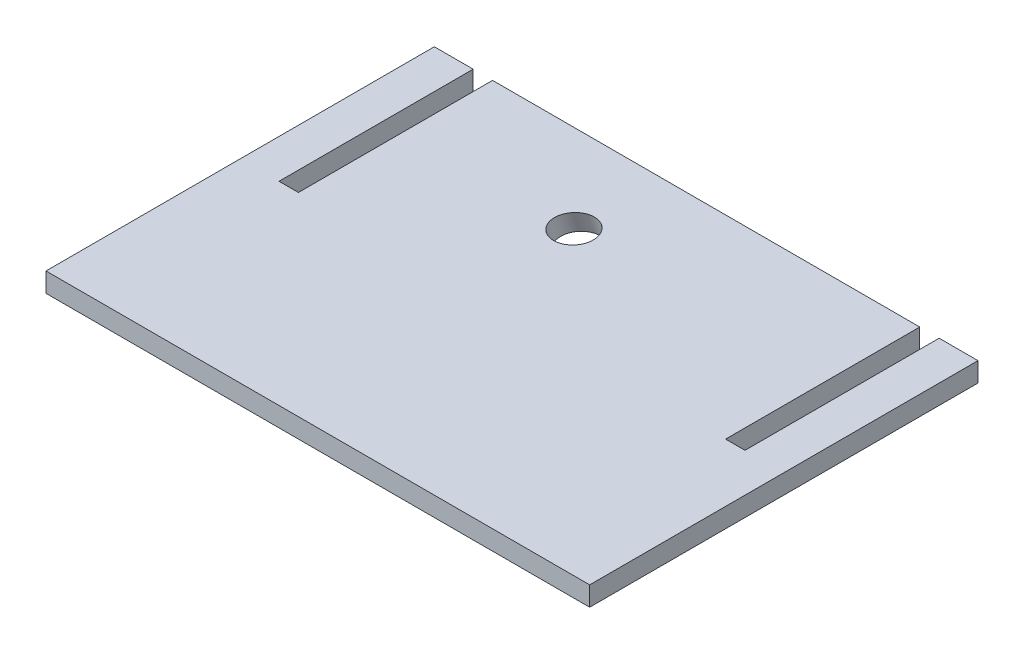
ISO-10303-21;
HEADER;
FILE_DESCRIPTION(('STEP AP214'),'2;1');
FILE_NAME('part.step','',(''),(''),'','','');
FILE_SCHEMA(('AUTOMOTIVE_DESIGN { 1 0 10303 214 1 1 1 1 }'));
ENDSEC;
DATA;
#1=APPLICATION_CONTEXT('core data for automotive mechanical design processes');
#2=APPLICATION_PROTOCOL_DEFINITION('international standard','automotive_design',2000,#1);
#3=PRODUCT_CONTEXT('',#1,'mechanical');
#4=PRODUCT('Part','Part','',(#3));
#5=PRODUCT_RELATED_PRODUCT_CATEGORY('part','',(#4));
#6=PRODUCT_DEFINITION_FORMATION('','',#4);
#7=PRODUCT_DEFINITION_CONTEXT('part definition',#1,'design');
#8=PRODUCT_DEFINITION('design','',#6,#7);
#9=PRODUCT_DEFINITION_SHAPE('','',#8);
#10=(LENGTH_UNIT() NAMED_UNIT(*) SI_UNIT(.MILLI.,.METRE.));
#11=(NAMED_UNIT(*) PLANE_ANGLE_UNIT() SI_UNIT($,.RADIAN.));
#12=(NAMED_UNIT(*) SI_UNIT($,.STERADIAN.) SOLID_ANGLE_UNIT());
#13=UNCERTAINTY_MEASURE_WITH_UNIT(LENGTH_MEASURE(1.E-05),#10,'distance_accuracy_value','');
#14=(GEOMETRIC_REPRESENTATION_CONTEXT(3) GLOBAL_UNCERTAINTY_ASSIGNED_CONTEXT((#13)) GLOBAL_UNIT_ASSIGNED_CONTEXT((#10,
#11,#12)) REPRESENTATION_CONTEXT('',''));
#15=CARTESIAN_POINT('',(0.,0.,0.));
#16=DIRECTION('',(0.,0.,1.));
#17=DIRECTION('',(1.,0.,0.));
#18=AXIS2_PLACEMENT_3D('',#15,#16,#17);
#19=CARTESIAN_POINT('',(-177.8,6.35,-127.));
#20=DIRECTION('',(0.,0.,1.));
#21=DIRECTION('',(1.,0.,0.));
#22=AXIS2_PLACEMENT_3D('',#19,#20,#21);
#23=PLANE('',#22);
#24=DIRECTION('',(-1.,0.,0.));
#25=VECTOR('',#24,1.);
#26=CARTESIAN_POINT('',(-177.8,6.35,-127.));
#27=LINE('',#26,#25);
#28=CARTESIAN_POINT('',(-152.4,6.35,-127.));
#29=VERTEX_POINT('',#28);
#30=CARTESIAN_POINT('',(-177.8,6.35,-127.));
#31=VERTEX_POINT('',#30);
#32=EDGE_CURVE('E193',#29,#31,#27,.T.);
#33=ORIENTED_EDGE('',*,*,#32,.F.);
#34=DIRECTION('',(0.,1.,0.));
#35=VECTOR('',#34,1.);
#36=CARTESIAN_POINT('',(-152.4,-6.35,-127.));
#37=LINE('',#36,#35);
#38=CARTESIAN_POINT('',(-152.4,-6.35,-127.));
#39=VERTEX_POINT('',#38);
#40=EDGE_CURVE('E179',#39,#29,#37,.T.);
#41=ORIENTED_EDGE('',*,*,#40,.F.);
#42=DIRECTION('',(-1.,0.,0.));
#43=VECTOR('',#42,1.);
#44=CARTESIAN_POINT('',(-177.8,-6.35,-127.));
#45=LINE('',#44,#43);
#46=CARTESIAN_POINT('',(-177.8,-6.35,-127.));
#47=VERTEX_POINT('',#46);
#48=EDGE_CURVE('E227',#39,#47,#45,.T.);
#49=ORIENTED_EDGE('',*,*,#48,.T.);
#50=DIRECTION('',(0.,-1.,0.));
#51=VECTOR('',#50,1.);
#52=CARTESIAN_POINT('',(-177.8,6.35,-127.));
#53=LINE('',#52,#51);
#54=EDGE_CURVE('E216',#31,#47,#53,.T.);
#55=ORIENTED_EDGE('',*,*,#54,.F.);
#56=EDGE_LOOP('',(#33,#41,#49,#55));
#57=FACE_BOUND('',#56,.T.);
#58=ADVANCED_FACE('F37',(#57),#23,.F.);
#59=CARTESIAN_POINT('',(139.7,-6.35,-127.));
#60=VERTEX_POINT('',#59);
#61=CARTESIAN_POINT('',(-139.7,-6.35,-127.));
#62=VERTEX_POINT('',#61);
#63=EDGE_CURVE('E178',#60,#62,#45,.T.);
#64=ORIENTED_EDGE('',*,*,#63,.T.);
#65=DIRECTION('',(0.,1.,0.));
#66=VECTOR('',#65,1.);
#67=CARTESIAN_POINT('',(-139.7,-6.35,-127.));
#68=LINE('',#67,#66);
#69=CARTESIAN_POINT('',(-139.7,6.35,-127.));
#70=VERTEX_POINT('',#69);
#71=EDGE_CURVE('E72',#62,#70,#68,.T.);
#72=ORIENTED_EDGE('',*,*,#71,.T.);
#73=CARTESIAN_POINT('',(139.7,6.35,-127.));
#74=VERTEX_POINT('',#73);
#75=EDGE_CURVE('E189',#74,#70,#27,.T.);
#76=ORIENTED_EDGE('',*,*,#75,.F.);
#77=DIRECTION('',(0.,1.,0.));
#78=VECTOR('',#77,1.);
#79=CARTESIAN_POINT('',(139.7,-6.35,-127.));
#80=LINE('',#79,#78);
#81=EDGE_CURVE('E162',#60,#74,#80,.T.);
#82=ORIENTED_EDGE('',*,*,#81,.F.);
#83=EDGE_LOOP('',(#64,#72,#76,#82));
#84=FACE_BOUND('',#83,.T.);
#85=ADVANCED_FACE('F253',(#84),#23,.F.);
#86=CARTESIAN_POINT('',(177.8,6.35,-127.));
#87=DIRECTION('',(-1.,0.,0.));
#88=DIRECTION('',(0.,0.,1.));
#89=AXIS2_PLACEMENT_3D('',#86,#87,#88);
#90=PLANE('',#89);
#91=DIRECTION('',(0.,0.,-1.));
#92=VECTOR('',#91,1.);
#93=CARTESIAN_POINT('',(177.8,-6.35,-127.));
#94=LINE('',#93,#92);
#95=CARTESIAN_POINT('',(177.8,-6.35,127.));
#96=VERTEX_POINT('',#95);
#97=CARTESIAN_POINT('',(177.8,-6.35,-127.));
#98=VERTEX_POINT('',#97);
#99=EDGE_CURVE('E177',#96,#98,#94,.T.);
#100=ORIENTED_EDGE('',*,*,#99,.T.);
#101=DIRECTION('',(0.,-1.,0.));
#102=VECTOR('',#101,1.);
#103=CARTESIAN_POINT('',(177.8,6.35,-127.));
#104=LINE('',#103,#102);
#105=CARTESIAN_POINT('',(177.8,6.35,-127.));
#106=VERTEX_POINT('',#105);
#107=EDGE_CURVE('E167',#106,#98,#104,.T.);
#108=ORIENTED_EDGE('',*,*,#107,.F.);
#109=DIRECTION('',(0.,0.,-1.));
#110=VECTOR('',#109,1.);
#111=CARTESIAN_POINT('',(177.8,6.35,-127.));
#112=LINE('',#111,#110);
#113=CARTESIAN_POINT('',(177.8,6.35,127.));
#114=VERTEX_POINT('',#113);
#115=EDGE_CURVE('E198',#114,#106,#112,.T.);
#116=ORIENTED_EDGE('',*,*,#115,.F.);
#117=DIRECTION('',(0.,-1.,0.));
#118=VECTOR('',#117,1.);
#119=CARTESIAN_POINT('',(177.8,6.35,127.));
#120=LINE('',#119,#118);
#121=EDGE_CURVE('E221',#114,#96,#120,.T.);
#122=ORIENTED_EDGE('',*,*,#121,.T.);
#123=EDGE_LOOP('',(#100,#108,#116,#122));
#124=FACE_BOUND('',#123,.T.);
#125=ADVANCED_FACE('F236',(#124),#90,.F.);
#126=CARTESIAN_POINT('',(152.4,-6.35,-127.));
#127=VERTEX_POINT('',#126);
#128=EDGE_CURVE('E168',#98,#127,#45,.T.);
#129=ORIENTED_EDGE('',*,*,#128,.T.);
#130=DIRECTION('',(0.,1.,0.));
#131=VECTOR('',#130,1.);
#132=CARTESIAN_POINT('',(152.4,-6.35,-127.));
#133=LINE('',#132,#131);
#134=CARTESIAN_POINT('',(152.4,6.35,-127.));
#135=VERTEX_POINT('',#134);
#136=EDGE_CURVE('E135',#127,#135,#133,.T.);
#137=ORIENTED_EDGE('',*,*,#136,.T.);
#138=EDGE_CURVE('E191',#106,#135,#27,.T.);
#139=ORIENTED_EDGE('',*,*,#138,.F.);
#140=ORIENTED_EDGE('',*,*,#107,.T.);
#141=EDGE_LOOP('',(#129,#137,#139,#140));
#142=FACE_BOUND('',#141,.T.);
#143=ADVANCED_FACE('F239',(#142),#23,.F.);
#144=CARTESIAN_POINT('',(-177.8,6.35,-127.));
#145=DIRECTION('',(1.,0.,0.));
#146=DIRECTION('',(0.,0.,-1.));
#147=AXIS2_PLACEMENT_3D('',#144,#145,#146);
#148=PLANE('',#147);
#149=DIRECTION('',(0.,0.,1.));
#150=VECTOR('',#149,1.);
#151=CARTESIAN_POINT('',(-177.8,-6.35,-127.));
#152=LINE('',#151,#150);
#153=CARTESIAN_POINT('',(-177.8,-6.35,127.));
#154=VERTEX_POINT('',#153);
#155=EDGE_CURVE('E224',#47,#154,#152,.T.);
#156=ORIENTED_EDGE('',*,*,#155,.T.);
#157=DIRECTION('',(0.,-1.,0.));
#158=VECTOR('',#157,1.);
#159=CARTESIAN_POINT('',(-177.8,6.35,127.));
#160=LINE('',#159,#158);
#161=CARTESIAN_POINT('',(-177.8,6.35,127.));
#162=VERTEX_POINT('',#161);
#163=EDGE_CURVE('E206',#162,#154,#160,.T.);
#164=ORIENTED_EDGE('',*,*,#163,.F.);
#165=DIRECTION('',(0.,0.,1.));
#166=VECTOR('',#165,1.);
#167=CARTESIAN_POINT('',(-177.8,6.35,-127.));
#168=LINE('',#167,#166);
#169=EDGE_CURVE('E200',#31,#162,#168,.T.);
#170=ORIENTED_EDGE('',*,*,#169,.F.);
#171=ORIENTED_EDGE('',*,*,#54,.T.);
#172=EDGE_LOOP('',(#156,#164,#170,#171));
#173=FACE_BOUND('',#172,.T.);
#174=ADVANCED_FACE('F243',(#173),#148,.F.);
#175=CARTESIAN_POINT('',(-177.8,6.35,127.));
#176=DIRECTION('',(0.,0.,-1.));
#177=DIRECTION('',(-1.,0.,0.));
#178=AXIS2_PLACEMENT_3D('',#175,#176,#177);
#179=PLANE('',#178);
#180=DIRECTION('',(1.,0.,0.));
#181=VECTOR('',#180,1.);
#182=CARTESIAN_POINT('',(-177.8,-6.35,127.));
#183=LINE('',#182,#181);
#184=EDGE_CURVE('E210',#154,#96,#183,.T.);
#185=ORIENTED_EDGE('',*,*,#184,.T.);
#186=ORIENTED_EDGE('',*,*,#121,.F.);
#187=DIRECTION('',(1.,0.,0.));
#188=VECTOR('',#187,1.);
#189=CARTESIAN_POINT('',(-177.8,6.35,127.));
#190=LINE('',#189,#188);
#191=EDGE_CURVE('E204',#162,#114,#190,.T.);
#192=ORIENTED_EDGE('',*,*,#191,.F.);
#193=ORIENTED_EDGE('',*,*,#163,.T.);
#194=EDGE_LOOP('',(#185,#186,#192,#193));
#195=FACE_BOUND('',#194,.T.);
#196=ADVANCED_FACE('F241',(#195),#179,.F.);
#197=CARTESIAN_POINT('',(0.,6.35,0.));
#198=DIRECTION('',(0.,1.,0.));
#199=DIRECTION('',(0.,0.,1.));
#200=AXIS2_PLACEMENT_3D('',#197,#198,#199);
#201=PLANE('',#200);
#202=CARTESIAN_POINT('',(-29.0632633217922,6.35,-69.5494140717823));
#203=DIRECTION('',(0.,1.,0.));
#204=DIRECTION('',(0.,0.,1.));
#205=AXIS2_PLACEMENT_3D('',#202,#203,#204);
#206=ELLIPSE('',#205,13.3301795384042,12.7);
#207=CARTESIAN_POINT('',(-29.0632633217924,6.35,-56.2192345333782));
#208=VERTEX_POINT('',#207);
#209=EDGE_CURVE('E41',#208,#208,#206,.F.);
#210=ORIENTED_EDGE('',*,*,#209,.T.);
#211=EDGE_LOOP('',(#210));
#212=FACE_BOUND('',#211,.T.);
#213=DIRECTION('',(0.,0.,1.));
#214=VECTOR('',#213,1.);
#215=CARTESIAN_POINT('',(-152.4,6.35,-127.));
#216=LINE('',#215,#214);
#217=CARTESIAN_POINT('',(-152.4,6.35,0.));
#218=VERTEX_POINT('',#217);
#219=EDGE_CURVE('E171',#29,#218,#216,.T.);
#220=ORIENTED_EDGE('',*,*,#219,.F.);
#221=ORIENTED_EDGE('',*,*,#32,.T.);
#222=ORIENTED_EDGE('',*,*,#169,.T.);
#223=ORIENTED_EDGE('',*,*,#191,.T.);
#224=ORIENTED_EDGE('',*,*,#115,.T.);
#225=ORIENTED_EDGE('',*,*,#138,.T.);
#226=DIRECTION('',(0.,0.,-1.));
#227=VECTOR('',#226,1.);
#228=CARTESIAN_POINT('',(152.4,6.35,-127.));
#229=LINE('',#228,#227);
#230=CARTESIAN_POINT('',(152.4,6.35,0.));
#231=VERTEX_POINT('',#230);
#232=EDGE_CURVE('E149',#231,#135,#229,.T.);
#233=ORIENTED_EDGE('',*,*,#232,.F.);
#234=DIRECTION('',(1.,0.,0.));
#235=VECTOR('',#234,1.);
#236=CARTESIAN_POINT('',(139.7,6.35,0.));
#237=LINE('',#236,#235);
#238=CARTESIAN_POINT('',(139.7,6.35,0.));
#239=VERTEX_POINT('',#238);
#240=EDGE_CURVE('E147',#239,#231,#237,.T.);
#241=ORIENTED_EDGE('',*,*,#240,.F.);
#242=DIRECTION('',(0.,0.,1.));
#243=VECTOR('',#242,1.);
#244=CARTESIAN_POINT('',(139.7,6.35,-127.));
#245=LINE('',#244,#243);
#246=EDGE_CURVE('E139',#74,#239,#245,.T.);
#247=ORIENTED_EDGE('',*,*,#246,.F.);
#248=ORIENTED_EDGE('',*,*,#75,.T.);
#249=DIRECTION('',(0.,0.,-1.));
#250=VECTOR('',#249,1.);
#251=CARTESIAN_POINT('',(-139.7,6.35,-127.));
#252=LINE('',#251,#250);
#253=CARTESIAN_POINT('',(-139.7,6.35,0.));
#254=VERTEX_POINT('',#253);
#255=EDGE_CURVE('E76',#254,#70,#252,.T.);
#256=ORIENTED_EDGE('',*,*,#255,.F.);
#257=DIRECTION('',(1.,0.,0.));
#258=VECTOR('',#257,1.);
#259=CARTESIAN_POINT('',(-152.4,6.35,0.));
#260=LINE('',#259,#258);
#261=EDGE_CURVE('E173',#218,#254,#260,.T.);
#262=ORIENTED_EDGE('',*,*,#261,.F.);
#263=EDGE_LOOP('',(#220,#221,#222,#223,#224,#225,#233,#241,#247,#248,#256,#262));
#264=FACE_BOUND('',#263,.T.);
#265=ADVANCED_FACE('F39',(#212,#264),#201,.T.);
#266=CARTESIAN_POINT('',(0.,-6.35,0.));
#267=DIRECTION('',(0.,1.,0.));
#268=DIRECTION('',(0.,0.,1.));
#269=AXIS2_PLACEMENT_3D('',#266,#267,#268);
#270=PLANE('',#269);
#271=CARTESIAN_POINT('',(-29.0632633217922,-6.35,-73.5995605538357));
#272=DIRECTION('',(0.,1.,0.));
#273=DIRECTION('',(0.,0.,1.));
#274=AXIS2_PLACEMENT_3D('',#271,#272,#273);
#275=ELLIPSE('',#274,13.3301795384042,12.7);
#276=CARTESIAN_POINT('',(-29.0632633217923,-6.35,-60.2693810154316));
#277=VERTEX_POINT('',#276);
#278=EDGE_CURVE('E11',#277,#277,#275,.F.);
#279=ORIENTED_EDGE('',*,*,#278,.F.);
#280=EDGE_LOOP('',(#279));
#281=FACE_BOUND('',#280,.T.);
#282=ORIENTED_EDGE('',*,*,#48,.F.);
#283=DIRECTION('',(0.,0.,1.));
#284=VECTOR('',#283,1.);
#285=CARTESIAN_POINT('',(-152.4,-6.35,-127.));
#286=LINE('',#285,#284);
#287=CARTESIAN_POINT('',(-152.4,-6.35,0.));
#288=VERTEX_POINT('',#287);
#289=EDGE_CURVE('E187',#39,#288,#286,.T.);
#290=ORIENTED_EDGE('',*,*,#289,.T.);
#291=DIRECTION('',(1.,0.,0.));
#292=VECTOR('',#291,1.);
#293=CARTESIAN_POINT('',(-152.4,-6.35,0.));
#294=LINE('',#293,#292);
#295=CARTESIAN_POINT('',(-139.7,-6.35,0.));
#296=VERTEX_POINT('',#295);
#297=EDGE_CURVE('E185',#288,#296,#294,.T.);
#298=ORIENTED_EDGE('',*,*,#297,.T.);
#299=DIRECTION('',(0.,0.,-1.));
#300=VECTOR('',#299,1.);
#301=CARTESIAN_POINT('',(-139.7,-6.35,-127.));
#302=LINE('',#301,#300);
#303=EDGE_CURVE('E156',#296,#62,#302,.T.);
#304=ORIENTED_EDGE('',*,*,#303,.T.);
#305=ORIENTED_EDGE('',*,*,#63,.F.);
#306=DIRECTION('',(0.,0.,1.));
#307=VECTOR('',#306,1.);
#308=CARTESIAN_POINT('',(139.7,-6.35,-127.));
#309=LINE('',#308,#307);
#310=CARTESIAN_POINT('',(139.7,-6.35,0.));
#311=VERTEX_POINT('',#310);
#312=EDGE_CURVE('E154',#60,#311,#309,.T.);
#313=ORIENTED_EDGE('',*,*,#312,.T.);
#314=DIRECTION('',(1.,0.,0.));
#315=VECTOR('',#314,1.);
#316=CARTESIAN_POINT('',(139.7,-6.35,0.));
#317=LINE('',#316,#315);
#318=CARTESIAN_POINT('',(152.4,-6.35,0.));
#319=VERTEX_POINT('',#318);
#320=EDGE_CURVE('E140',#311,#319,#317,.T.);
#321=ORIENTED_EDGE('',*,*,#320,.T.);
#322=DIRECTION('',(0.,0.,-1.));
#323=VECTOR('',#322,1.);
#324=CARTESIAN_POINT('',(152.4,-6.35,-127.));
#325=LINE('',#324,#323);
#326=EDGE_CURVE('E129',#319,#127,#325,.T.);
#327=ORIENTED_EDGE('',*,*,#326,.T.);
#328=ORIENTED_EDGE('',*,*,#128,.F.);
#329=ORIENTED_EDGE('',*,*,#99,.F.);
#330=ORIENTED_EDGE('',*,*,#184,.F.);
#331=ORIENTED_EDGE('',*,*,#155,.F.);
#332=EDGE_LOOP('',(#282,#290,#298,#304,#305,#313,#321,#327,#328,#329,#330,#331));
#333=FACE_BOUND('',#332,.T.);
#334=ADVANCED_FACE('F152',(#281,#333),#270,.F.);
#335=CARTESIAN_POINT('',(139.7,-6.35,-127.));
#336=DIRECTION('',(-1.,0.,0.));
#337=DIRECTION('',(0.,0.,1.));
#338=AXIS2_PLACEMENT_3D('',#335,#336,#337);
#339=PLANE('',#338);
#340=ORIENTED_EDGE('',*,*,#246,.T.);
#341=DIRECTION('',(0.,1.,0.));
#342=VECTOR('',#341,1.);
#343=CARTESIAN_POINT('',(139.7,-6.35,0.));
#344=LINE('',#343,#342);
#345=EDGE_CURVE('E164',#311,#239,#344,.T.);
#346=ORIENTED_EDGE('',*,*,#345,.F.);
#347=ORIENTED_EDGE('',*,*,#312,.F.);
#348=ORIENTED_EDGE('',*,*,#81,.T.);
#349=EDGE_LOOP('',(#340,#346,#347,#348));
#350=FACE_BOUND('',#349,.T.);
#351=ADVANCED_FACE('F320',(#350),#339,.F.);
#352=CARTESIAN_POINT('',(152.4,-6.35,-127.));
#353=DIRECTION('',(1.,0.,0.));
#354=DIRECTION('',(0.,0.,-1.));
#355=AXIS2_PLACEMENT_3D('',#352,#353,#354);
#356=PLANE('',#355);
#357=ORIENTED_EDGE('',*,*,#232,.T.);
#358=ORIENTED_EDGE('',*,*,#136,.F.);
#359=ORIENTED_EDGE('',*,*,#326,.F.);
#360=DIRECTION('',(0.,1.,0.));
#361=VECTOR('',#360,1.);
#362=CARTESIAN_POINT('',(152.4,-6.35,0.));
#363=LINE('',#362,#361);
#364=EDGE_CURVE('E132',#319,#231,#363,.T.);
#365=ORIENTED_EDGE('',*,*,#364,.T.);
#366=EDGE_LOOP('',(#357,#358,#359,#365));
#367=FACE_BOUND('',#366,.T.);
#368=ADVANCED_FACE('F131',(#367),#356,.F.);
#369=CARTESIAN_POINT('',(139.7,-6.35,0.));
#370=DIRECTION('',(0.,0.,1.));
#371=DIRECTION('',(1.,0.,0.));
#372=AXIS2_PLACEMENT_3D('',#369,#370,#371);
#373=PLANE('',#372);
#374=ORIENTED_EDGE('',*,*,#240,.T.);
#375=ORIENTED_EDGE('',*,*,#364,.F.);
#376=ORIENTED_EDGE('',*,*,#320,.F.);
#377=ORIENTED_EDGE('',*,*,#345,.T.);
#378=EDGE_LOOP('',(#374,#375,#376,#377));
#379=FACE_BOUND('',#378,.T.);
#380=ADVANCED_FACE('F144',(#379),#373,.F.);
#381=CARTESIAN_POINT('',(-152.4,-6.35,-127.));
#382=DIRECTION('',(-1.,0.,0.));
#383=DIRECTION('',(0.,0.,1.));
#384=AXIS2_PLACEMENT_3D('',#381,#382,#383);
#385=PLANE('',#384);
#386=ORIENTED_EDGE('',*,*,#219,.T.);
#387=DIRECTION('',(0.,1.,0.));
#388=VECTOR('',#387,1.);
#389=CARTESIAN_POINT('',(-152.4,-6.35,0.));
#390=LINE('',#389,#388);
#391=EDGE_CURVE('E47',#288,#218,#390,.T.);
#392=ORIENTED_EDGE('',*,*,#391,.F.);
#393=ORIENTED_EDGE('',*,*,#289,.F.);
#394=ORIENTED_EDGE('',*,*,#40,.T.);
#395=EDGE_LOOP('',(#386,#392,#393,#394));
#396=FACE_BOUND('',#395,.T.);
#397=ADVANCED_FACE('F348',(#396),#385,.F.);
#398=CARTESIAN_POINT('',(-139.7,-6.35,-127.));
#399=DIRECTION('',(1.,0.,0.));
#400=DIRECTION('',(0.,0.,-1.));
#401=AXIS2_PLACEMENT_3D('',#398,#399,#400);
#402=PLANE('',#401);
#403=ORIENTED_EDGE('',*,*,#255,.T.);
#404=ORIENTED_EDGE('',*,*,#71,.F.);
#405=ORIENTED_EDGE('',*,*,#303,.F.);
#406=DIRECTION('',(0.,1.,0.));
#407=VECTOR('',#406,1.);
#408=CARTESIAN_POINT('',(-139.7,-6.35,0.));
#409=LINE('',#408,#407);
#410=EDGE_CURVE('E174',#296,#254,#409,.T.);
#411=ORIENTED_EDGE('',*,*,#410,.T.);
#412=EDGE_LOOP('',(#403,#404,#405,#411));
#413=FACE_BOUND('',#412,.T.);
#414=ADVANCED_FACE('F358',(#413),#402,.F.);
#415=CARTESIAN_POINT('',(-152.4,-6.35,0.));
#416=DIRECTION('',(0.,0.,1.));
#417=DIRECTION('',(1.,0.,0.));
#418=AXIS2_PLACEMENT_3D('',#415,#416,#417);
#419=PLANE('',#418);
#420=ORIENTED_EDGE('',*,*,#261,.T.);
#421=ORIENTED_EDGE('',*,*,#410,.F.);
#422=ORIENTED_EDGE('',*,*,#297,.F.);
#423=ORIENTED_EDGE('',*,*,#391,.T.);
#424=EDGE_LOOP('',(#420,#421,#422,#423));
#425=FACE_BOUND('',#424,.T.);
#426=ADVANCED_FACE('F369',(#425),#419,.F.);
#427=CARTESIAN_POINT('',(-29.0632633217921,-44.450000000002,-85.7499999999964));
#428=DIRECTION('',(0.,0.952725352528927,0.303832853142369));
#429=DIRECTION('',(0.,0.303832853142369,-0.952725352528927));
#430=AXIS2_PLACEMENT_3D('',#427,#428,#429);
#431=CYLINDRICAL_SURFACE('',#430,12.7);
#432=ORIENTED_EDGE('',*,*,#209,.F.);
#433=EDGE_LOOP('',(#432));
#434=FACE_BOUND('',#433,.T.);
#435=ORIENTED_EDGE('',*,*,#278,.T.);
#436=EDGE_LOOP('',(#435));
#437=FACE_BOUND('',#436,.T.);
#438=ADVANCED_FACE('F379',(#434,#437),#431,.F.);
#439=CLOSED_SHELL('',(#58,#85,#125,#143,#174,#196,#265,#334,#351,#368,#380,#397,#414,#426,#438));
#440=MANIFOLD_SOLID_BREP('B2',#439);
#441=ADVANCED_BREP_SHAPE_REPRESENTATION('',(#18,#440),#14);
#442=SHAPE_DEFINITION_REPRESENTATION(#9,#441);
ENDSEC;
END-ISO-10303-21;
